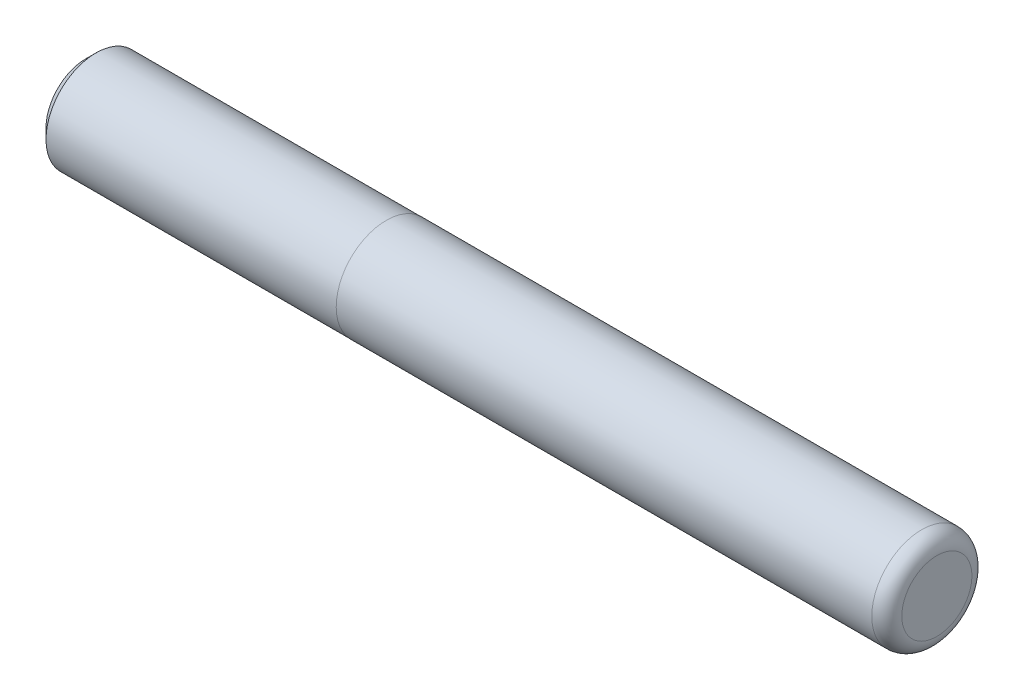
ISO-10303-21;
HEADER;
FILE_DESCRIPTION(('STEP AP214'),'2;1');
FILE_NAME('part.step','',(''),(''),'','','');
FILE_SCHEMA(('AUTOMOTIVE_DESIGN { 1 0 10303 214 1 1 1 1 }'));
ENDSEC;
DATA;
#1=APPLICATION_CONTEXT('core data for automotive mechanical design processes');
#2=APPLICATION_PROTOCOL_DEFINITION('international standard','automotive_design',2000,#1);
#3=PRODUCT_CONTEXT('',#1,'mechanical');
#4=PRODUCT('Part','Part','',(#3));
#5=PRODUCT_RELATED_PRODUCT_CATEGORY('part','',(#4));
#6=PRODUCT_DEFINITION_FORMATION('','',#4);
#7=PRODUCT_DEFINITION_CONTEXT('part definition',#1,'design');
#8=PRODUCT_DEFINITION('design','',#6,#7);
#9=PRODUCT_DEFINITION_SHAPE('','',#8);
#10=(LENGTH_UNIT() NAMED_UNIT(*) SI_UNIT(.MILLI.,.METRE.));
#11=(NAMED_UNIT(*) PLANE_ANGLE_UNIT() SI_UNIT($,.RADIAN.));
#12=(NAMED_UNIT(*) SI_UNIT($,.STERADIAN.) SOLID_ANGLE_UNIT());
#13=UNCERTAINTY_MEASURE_WITH_UNIT(LENGTH_MEASURE(1.E-05),#10,'distance_accuracy_value','');
#14=(GEOMETRIC_REPRESENTATION_CONTEXT(3) GLOBAL_UNCERTAINTY_ASSIGNED_CONTEXT((#13)) GLOBAL_UNIT_ASSIGNED_CONTEXT((#10,
#11,#12)) REPRESENTATION_CONTEXT('',''));
#15=CARTESIAN_POINT('',(0.,0.,0.));
#16=DIRECTION('',(0.,0.,1.));
#17=DIRECTION('',(1.,0.,0.));
#18=AXIS2_PLACEMENT_3D('',#15,#16,#17);
#19=CARTESIAN_POINT('',(0.,0.,0.));
#20=DIRECTION('',(-1.,0.,0.));
#21=DIRECTION('',(0.,0.,1.));
#22=AXIS2_PLACEMENT_3D('',#19,#20,#21);
#23=PLANE('',#22);
#24=CARTESIAN_POINT('',(0.,0.,0.));
#25=DIRECTION('',(-1.,0.,0.));
#26=DIRECTION('',(0.,0.,1.));
#27=AXIS2_PLACEMENT_3D('',#24,#25,#26);
#28=CIRCLE('',#27,3.5);
#29=CARTESIAN_POINT('',(0.,0.,3.5));
#30=VERTEX_POINT('',#29);
#31=EDGE_CURVE('E10',#30,#30,#28,.T.);
#32=ORIENTED_EDGE('',*,*,#31,.F.);
#33=EDGE_LOOP('',(#32));
#34=FACE_BOUND('',#33,.T.);
#35=ADVANCED_FACE('F35',(#34),#23,.F.);
#36=CARTESIAN_POINT('',(-1.5,0.,0.));
#37=DIRECTION('',(-1.,0.,0.));
#38=DIRECTION('',(0.,0.,1.));
#39=AXIS2_PLACEMENT_3D('',#36,#37,#38);
#40=TOROIDAL_SURFACE('',#39,3.5,1.5);
#41=CARTESIAN_POINT('',(-1.5,0.,0.));
#42=DIRECTION('',(-1.,0.,0.));
#43=DIRECTION('',(0.,0.,1.));
#44=AXIS2_PLACEMENT_3D('',#41,#42,#43);
#45=CIRCLE('',#44,5.);
#46=CARTESIAN_POINT('',(-1.5,0.,5.));
#47=VERTEX_POINT('',#46);
#48=EDGE_CURVE('E41',#47,#47,#45,.T.);
#49=ORIENTED_EDGE('',*,*,#48,.F.);
#50=EDGE_LOOP('',(#49));
#51=FACE_BOUND('',#50,.T.);
#52=ORIENTED_EDGE('',*,*,#31,.T.);
#53=EDGE_LOOP('',(#52));
#54=FACE_BOUND('',#53,.T.);
#55=ADVANCED_FACE('F83',(#51,#54),#40,.T.);
#56=CARTESIAN_POINT('',(-85.,0.,0.));
#57=DIRECTION('',(-1.,0.,0.));
#58=DIRECTION('',(0.,0.,1.));
#59=AXIS2_PLACEMENT_3D('',#56,#57,#58);
#60=CYLINDRICAL_SURFACE('',#59,5.);
#61=CARTESIAN_POINT('',(-55.,0.,0.));
#62=DIRECTION('',(-1.,0.,0.));
#63=DIRECTION('',(0.,0.,1.));
#64=AXIS2_PLACEMENT_3D('',#61,#62,#63);
#65=CIRCLE('',#64,4.99999999999999);
#66=CARTESIAN_POINT('',(-55.,0.,4.99999999999999));
#67=VERTEX_POINT('',#66);
#68=EDGE_CURVE('E45',#67,#67,#65,.T.);
#69=ORIENTED_EDGE('',*,*,#68,.F.);
#70=EDGE_LOOP('',(#69));
#71=FACE_BOUND('',#70,.T.);
#72=ORIENTED_EDGE('',*,*,#48,.T.);
#73=EDGE_LOOP('',(#72));
#74=FACE_BOUND('',#73,.T.);
#75=ADVANCED_FACE('F78',(#71,#74),#60,.T.);
#76=CARTESIAN_POINT('',(-55.,0.,0.));
#77=DIRECTION('',(1.,0.,0.));
#78=DIRECTION('',(0.,0.,-1.));
#79=AXIS2_PLACEMENT_3D('',#76,#77,#78);
#80=PLANE('',#79);
#81=CARTESIAN_POINT('',(-55.,0.,0.));
#82=DIRECTION('',(-1.,0.,0.));
#83=DIRECTION('',(0.,0.,1.));
#84=AXIS2_PLACEMENT_3D('',#81,#82,#83);
#85=CIRCLE('',#84,4.99);
#86=CARTESIAN_POINT('',(-55.,0.,4.99));
#87=VERTEX_POINT('',#86);
#88=EDGE_CURVE('E49',#87,#87,#85,.T.);
#89=ORIENTED_EDGE('',*,*,#88,.F.);
#90=EDGE_LOOP('',(#89));
#91=FACE_BOUND('',#90,.T.);
#92=ORIENTED_EDGE('',*,*,#68,.T.);
#93=EDGE_LOOP('',(#92));
#94=FACE_BOUND('',#93,.T.);
#95=ADVANCED_FACE('F72',(#91,#94),#80,.F.);
#96=CARTESIAN_POINT('',(-85.,0.,0.));
#97=DIRECTION('',(-1.,0.,0.));
#98=DIRECTION('',(0.,0.,1.));
#99=AXIS2_PLACEMENT_3D('',#96,#97,#98);
#100=CYLINDRICAL_SURFACE('',#99,4.99);
#101=CARTESIAN_POINT('',(-84.,0.,0.));
#102=DIRECTION('',(-1.,0.,0.));
#103=DIRECTION('',(0.,0.,1.));
#104=AXIS2_PLACEMENT_3D('',#101,#102,#103);
#105=CIRCLE('',#104,4.99);
#106=CARTESIAN_POINT('',(-84.,0.,4.99));
#107=VERTEX_POINT('',#106);
#108=EDGE_CURVE('E54',#107,#107,#105,.T.);
#109=ORIENTED_EDGE('',*,*,#108,.F.);
#110=EDGE_LOOP('',(#109));
#111=FACE_BOUND('',#110,.T.);
#112=ORIENTED_EDGE('',*,*,#88,.T.);
#113=EDGE_LOOP('',(#112));
#114=FACE_BOUND('',#113,.T.);
#115=ADVANCED_FACE('F66',(#111,#114),#100,.T.);
#116=CARTESIAN_POINT('',(-84.,0.,0.));
#117=DIRECTION('',(1.,0.,0.));
#118=DIRECTION('',(0.,0.,-1.));
#119=AXIS2_PLACEMENT_3D('',#116,#117,#118);
#120=CONICAL_SURFACE('',#119,4.99,0.785398163397448);
#121=CARTESIAN_POINT('',(-85.,0.,0.));
#122=DIRECTION('',(-1.,0.,0.));
#123=DIRECTION('',(0.,0.,1.));
#124=AXIS2_PLACEMENT_3D('',#121,#122,#123);
#125=CIRCLE('',#124,3.99);
#126=CARTESIAN_POINT('',(-85.,0.,3.99));
#127=VERTEX_POINT('',#126);
#128=EDGE_CURVE('E57',#127,#127,#125,.T.);
#129=ORIENTED_EDGE('',*,*,#128,.F.);
#130=EDGE_LOOP('',(#129));
#131=FACE_BOUND('',#130,.T.);
#132=ORIENTED_EDGE('',*,*,#108,.T.);
#133=EDGE_LOOP('',(#132));
#134=FACE_BOUND('',#133,.T.);
#135=ADVANCED_FACE('F63',(#131,#134),#120,.T.);
#136=CARTESIAN_POINT('',(-85.,0.,0.));
#137=DIRECTION('',(1.,0.,0.));
#138=DIRECTION('',(0.,0.,-1.));
#139=AXIS2_PLACEMENT_3D('',#136,#137,#138);
#140=PLANE('',#139);
#141=ORIENTED_EDGE('',*,*,#128,.T.);
#142=EDGE_LOOP('',(#141));
#143=FACE_BOUND('',#142,.T.);
#144=ADVANCED_FACE('F61',(#143),#140,.F.);
#145=CLOSED_SHELL('',(#35,#55,#75,#95,#115,#135,#144));
#146=MANIFOLD_SOLID_BREP('B2',#145);
#147=ADVANCED_BREP_SHAPE_REPRESENTATION('',(#18,#146),#14);
#148=SHAPE_DEFINITION_REPRESENTATION(#9,#147);
ENDSEC;
END-ISO-10303-21;
